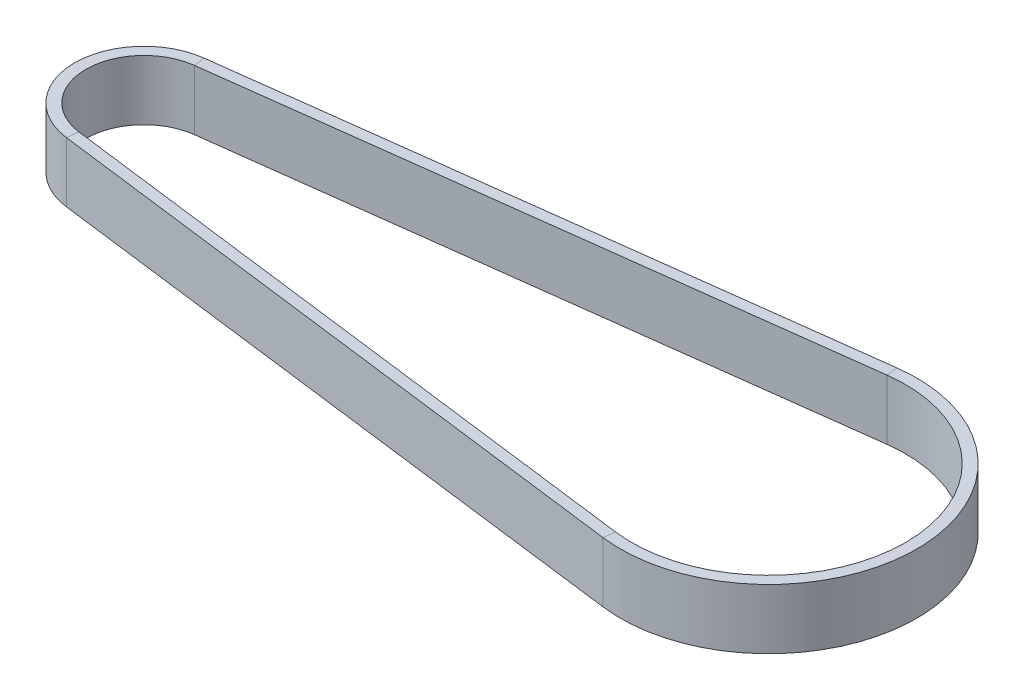
ISO-10303-21;
HEADER;
FILE_DESCRIPTION(('STEP AP214'),'2;1');
FILE_NAME('part.step','',(''),(''),'','','');
FILE_SCHEMA(('AUTOMOTIVE_DESIGN { 1 0 10303 214 1 1 1 1 }'));
ENDSEC;
DATA;
#1=APPLICATION_CONTEXT('core data for automotive mechanical design processes');
#2=APPLICATION_PROTOCOL_DEFINITION('international standard','automotive_design',2000,#1);
#3=PRODUCT_CONTEXT('',#1,'mechanical');
#4=PRODUCT('Part','Part','',(#3));
#5=PRODUCT_RELATED_PRODUCT_CATEGORY('part','',(#4));
#6=PRODUCT_DEFINITION_FORMATION('','',#4);
#7=PRODUCT_DEFINITION_CONTEXT('part definition',#1,'design');
#8=PRODUCT_DEFINITION('design','',#6,#7);
#9=PRODUCT_DEFINITION_SHAPE('','',#8);
#10=(LENGTH_UNIT() NAMED_UNIT(*) SI_UNIT(.MILLI.,.METRE.));
#11=(NAMED_UNIT(*) PLANE_ANGLE_UNIT() SI_UNIT($,.RADIAN.));
#12=(NAMED_UNIT(*) SI_UNIT($,.STERADIAN.) SOLID_ANGLE_UNIT());
#13=UNCERTAINTY_MEASURE_WITH_UNIT(LENGTH_MEASURE(1.E-05),#10,'distance_accuracy_value','');
#14=(GEOMETRIC_REPRESENTATION_CONTEXT(3) GLOBAL_UNCERTAINTY_ASSIGNED_CONTEXT((#13)) GLOBAL_UNIT_ASSIGNED_CONTEXT((#10,
#11,#12)) REPRESENTATION_CONTEXT('',''));
#15=CARTESIAN_POINT('',(0.,0.,0.));
#16=DIRECTION('',(0.,0.,1.));
#17=DIRECTION('',(1.,0.,0.));
#18=AXIS2_PLACEMENT_3D('',#15,#16,#17);
#19=CARTESIAN_POINT('',(916.037735882682,0.,128.730051616606));
#20=DIRECTION('',(0.,1.,0.));
#21=DIRECTION('',(0.,0.,1.));
#22=AXIS2_PLACEMENT_3D('',#19,#20,#21);
#23=CYLINDRICAL_SURFACE('',#22,36.5);
#24=DIRECTION('',(0.,-1.,0.));
#25=VECTOR('',#24,1.);
#26=CARTESIAN_POINT('',(911.435631291215,8.,164.938760974013));
#27=LINE('',#26,#25);
#28=CARTESIAN_POINT('',(911.435631291215,8.,164.938760974013));
#29=VERTEX_POINT('',#28);
#30=CARTESIAN_POINT('',(911.435631291215,-8.,164.938760974013));
#31=VERTEX_POINT('',#30);
#32=EDGE_CURVE('E149',#29,#31,#27,.T.);
#33=ORIENTED_EDGE('',*,*,#32,.F.);
#34=CARTESIAN_POINT('',(916.037735882682,8.,128.730051616606));
#35=DIRECTION('',(0.,1.,0.));
#36=DIRECTION('',(-0.126085057300454,0.,0.992019434449518));
#37=AXIS2_PLACEMENT_3D('',#34,#35,#36);
#38=CIRCLE('',#37,36.5);
#39=CARTESIAN_POINT('',(911.435631291216,8.,92.5213422591982));
#40=VERTEX_POINT('',#39);
#41=EDGE_CURVE('E148',#29,#40,#38,.T.);
#42=ORIENTED_EDGE('',*,*,#41,.T.);
#43=DIRECTION('',(0.,-1.,0.));
#44=VECTOR('',#43,1.);
#45=CARTESIAN_POINT('',(911.435631291216,8.,92.5213422591982));
#46=LINE('',#45,#44);
#47=CARTESIAN_POINT('',(911.435631291216,-8.,92.5213422591982));
#48=VERTEX_POINT('',#47);
#49=EDGE_CURVE('E127',#40,#48,#46,.T.);
#50=ORIENTED_EDGE('',*,*,#49,.T.);
#51=CARTESIAN_POINT('',(916.037735882682,-8.,128.730051616606));
#52=DIRECTION('',(0.,1.,0.));
#53=DIRECTION('',(-0.126085057300454,0.,0.992019434449518));
#54=AXIS2_PLACEMENT_3D('',#51,#52,#53);
#55=CIRCLE('',#54,36.5);
#56=EDGE_CURVE('E153',#31,#48,#55,.T.);
#57=ORIENTED_EDGE('',*,*,#56,.F.);
#58=EDGE_LOOP('',(#33,#42,#50,#57));
#59=FACE_BOUND('',#58,.T.);
#60=ADVANCED_FACE('F33',(#59),#23,.F.);
#61=CARTESIAN_POINT('',(911.435631291216,8.,92.5213422591982));
#62=DIRECTION('',(-0.126085057300452,0.,-0.992019434449518));
#63=DIRECTION('',(-0.992019434449518,0.,0.126085057300452));
#64=AXIS2_PLACEMENT_3D('',#61,#62,#63);
#65=PLANE('',#64);
#66=DIRECTION('',(-0.992019434449518,0.,0.126085057300452));
#67=VECTOR('',#66,1.);
#68=CARTESIAN_POINT('',(911.435631291216,-8.,92.5213422591982));
#69=LINE('',#68,#67);
#70=CARTESIAN_POINT('',(747.529184585241,-8.,113.353750382638));
#71=VERTEX_POINT('',#70);
#72=EDGE_CURVE('E117',#48,#71,#69,.T.);
#73=ORIENTED_EDGE('',*,*,#72,.F.);
#74=ORIENTED_EDGE('',*,*,#49,.F.);
#75=DIRECTION('',(-0.992019434449518,0.,0.126085057300452));
#76=VECTOR('',#75,1.);
#77=CARTESIAN_POINT('',(911.435631291216,8.,92.5213422591982));
#78=LINE('',#77,#76);
#79=CARTESIAN_POINT('',(747.529184585241,8.,113.353750382638));
#80=VERTEX_POINT('',#79);
#81=EDGE_CURVE('E130',#40,#80,#78,.T.);
#82=ORIENTED_EDGE('',*,*,#81,.T.);
#83=DIRECTION('',(0.,-1.,0.));
#84=VECTOR('',#83,1.);
#85=CARTESIAN_POINT('',(747.529184585241,8.,113.353750382638));
#86=LINE('',#85,#84);
#87=EDGE_CURVE('E145',#80,#71,#86,.T.);
#88=ORIENTED_EDGE('',*,*,#87,.T.);
#89=EDGE_LOOP('',(#73,#74,#82,#88));
#90=FACE_BOUND('',#89,.T.);
#91=ADVANCED_FACE('F129',(#90),#65,.F.);
#92=CARTESIAN_POINT('',(911.435631291216,-8.,92.5213422591982));
#93=DIRECTION('',(0.,1.,0.));
#94=DIRECTION('',(0.,0.,1.));
#95=AXIS2_PLACEMENT_3D('',#92,#93,#94);
#96=PLANE('',#95);
#97=DIRECTION('',(-0.992019434449518,0.,0.126085057300452));
#98=VECTOR('',#97,1.);
#99=CARTESIAN_POINT('',(911.057376119314,-8.,89.5452839558497));
#100=LINE('',#99,#98);
#101=CARTESIAN_POINT('',(911.057376119314,-8.,89.5452839558497));
#102=VERTEX_POINT('',#101);
#103=CARTESIAN_POINT('',(747.150929413339,-8.,110.37769207929));
#104=VERTEX_POINT('',#103);
#105=EDGE_CURVE('E111',#102,#104,#100,.T.);
#106=ORIENTED_EDGE('',*,*,#105,.F.);
#107=DIRECTION('',(-0.126085057300458,0.,-0.992019434449517));
#108=VECTOR('',#107,1.);
#109=CARTESIAN_POINT('',(911.435631291216,-8.,92.5213422591982));
#110=LINE('',#109,#108);
#111=EDGE_CURVE('E135',#48,#102,#110,.T.);
#112=ORIENTED_EDGE('',*,*,#111,.F.);
#113=ORIENTED_EDGE('',*,*,#72,.T.);
#114=DIRECTION('',(-0.126085057300458,0.,-0.992019434449517));
#115=VECTOR('',#114,1.);
#116=CARTESIAN_POINT('',(747.529184585241,-8.,113.353750382638));
#117=LINE('',#116,#115);
#118=EDGE_CURVE('E200',#71,#104,#117,.T.);
#119=ORIENTED_EDGE('',*,*,#118,.T.);
#120=EDGE_LOOP('',(#106,#112,#113,#119));
#121=FACE_BOUND('',#120,.T.);
#122=ADVANCED_FACE('F216',(#121),#96,.F.);
#123=CARTESIAN_POINT('',(911.057376119314,8.,89.5452839558497));
#124=DIRECTION('',(0.126085057300452,0.,0.992019434449518));
#125=DIRECTION('',(0.992019434449518,0.,-0.126085057300452));
#126=AXIS2_PLACEMENT_3D('',#123,#124,#125);
#127=PLANE('',#126);
#128=DIRECTION('',(-0.992019434449518,0.,0.126085057300452));
#129=VECTOR('',#128,1.);
#130=CARTESIAN_POINT('',(911.057376119314,8.,89.5452839558497));
#131=LINE('',#130,#129);
#132=CARTESIAN_POINT('',(911.057376119314,8.,89.5452839558497));
#133=VERTEX_POINT('',#132);
#134=CARTESIAN_POINT('',(747.150929413339,8.,110.37769207929));
#135=VERTEX_POINT('',#134);
#136=EDGE_CURVE('E163',#133,#135,#131,.T.);
#137=ORIENTED_EDGE('',*,*,#136,.F.);
#138=DIRECTION('',(0.,1.,0.));
#139=VECTOR('',#138,1.);
#140=CARTESIAN_POINT('',(911.057376119314,8.,89.5452839558497));
#141=LINE('',#140,#139);
#142=EDGE_CURVE('E156',#102,#133,#141,.T.);
#143=ORIENTED_EDGE('',*,*,#142,.F.);
#144=ORIENTED_EDGE('',*,*,#105,.T.);
#145=DIRECTION('',(0.,1.,0.));
#146=VECTOR('',#145,1.);
#147=CARTESIAN_POINT('',(747.150929413339,8.,110.37769207929));
#148=LINE('',#147,#146);
#149=EDGE_CURVE('E185',#104,#135,#148,.T.);
#150=ORIENTED_EDGE('',*,*,#149,.T.);
#151=EDGE_LOOP('',(#137,#143,#144,#150));
#152=FACE_BOUND('',#151,.T.);
#153=ADVANCED_FACE('F186',(#152),#127,.F.);
#154=CARTESIAN_POINT('',(911.435631291216,8.,92.5213422591982));
#155=DIRECTION('',(0.,-1.,0.));
#156=DIRECTION('',(0.,0.,-1.));
#157=AXIS2_PLACEMENT_3D('',#154,#155,#156);
#158=PLANE('',#157);
#159=DIRECTION('',(0.126085057300458,0.,0.992019434449517));
#160=VECTOR('',#159,1.);
#161=CARTESIAN_POINT('',(747.529184585241,8.,113.353750382638));
#162=LINE('',#161,#160);
#163=EDGE_CURVE('E143',#135,#80,#162,.T.);
#164=ORIENTED_EDGE('',*,*,#163,.T.);
#165=ORIENTED_EDGE('',*,*,#81,.F.);
#166=DIRECTION('',(0.126085057300458,0.,0.992019434449517));
#167=VECTOR('',#166,1.);
#168=CARTESIAN_POINT('',(911.435631291216,8.,92.5213422591982));
#169=LINE('',#168,#167);
#170=EDGE_CURVE('E142',#133,#40,#169,.T.);
#171=ORIENTED_EDGE('',*,*,#170,.F.);
#172=ORIENTED_EDGE('',*,*,#136,.T.);
#173=EDGE_LOOP('',(#164,#165,#171,#172));
#174=FACE_BOUND('',#173,.T.);
#175=ADVANCED_FACE('F140',(#174),#158,.F.);
#176=CARTESIAN_POINT('',(749.483502973397,0.,128.730051616606));
#177=DIRECTION('',(0.,1.,0.));
#178=DIRECTION('',(0.,0.,1.));
#179=AXIS2_PLACEMENT_3D('',#176,#177,#178);
#180=CYLINDRICAL_SURFACE('',#179,15.500000000002);
#181=CARTESIAN_POINT('',(749.483502973397,-8.,128.730051616606));
#182=DIRECTION('',(0.,1.,0.));
#183=DIRECTION('',(-0.126085057300411,0.,-0.992019434449523));
#184=AXIS2_PLACEMENT_3D('',#181,#182,#183);
#185=CIRCLE('',#184,15.500000000002);
#186=CARTESIAN_POINT('',(747.52918458524,-8.,144.106352850575));
#187=VERTEX_POINT('',#186);
#188=EDGE_CURVE('E98',#71,#187,#185,.T.);
#189=ORIENTED_EDGE('',*,*,#188,.F.);
#190=ORIENTED_EDGE('',*,*,#87,.F.);
#191=CARTESIAN_POINT('',(749.483502973397,8.,128.730051616606));
#192=DIRECTION('',(0.,1.,0.));
#193=DIRECTION('',(-0.126085057300412,0.,-0.992019434449523));
#194=AXIS2_PLACEMENT_3D('',#191,#192,#193);
#195=CIRCLE('',#194,15.500000000002);
#196=CARTESIAN_POINT('',(747.52918458524,8.,144.106352850575));
#197=VERTEX_POINT('',#196);
#198=EDGE_CURVE('E162',#80,#197,#195,.T.);
#199=ORIENTED_EDGE('',*,*,#198,.T.);
#200=DIRECTION('',(0.,-1.,0.));
#201=VECTOR('',#200,1.);
#202=CARTESIAN_POINT('',(747.52918458524,8.,144.106352850573));
#203=LINE('',#202,#201);
#204=EDGE_CURVE('E191',#197,#187,#203,.T.);
#205=ORIENTED_EDGE('',*,*,#204,.T.);
#206=EDGE_LOOP('',(#189,#190,#199,#205));
#207=FACE_BOUND('',#206,.T.);
#208=ADVANCED_FACE('F215',(#207),#180,.F.);
#209=CARTESIAN_POINT('',(747.529184585241,-8.,113.353750382636));
#210=DIRECTION('',(0.,1.,0.));
#211=DIRECTION('',(0.,0.,1.));
#212=AXIS2_PLACEMENT_3D('',#209,#210,#211);
#213=PLANE('',#212);
#214=CARTESIAN_POINT('',(749.483502973397,-8.,128.730051616606));
#215=DIRECTION('',(0.,1.,0.));
#216=DIRECTION('',(-0.126085057300419,0.,-0.992019434449522));
#217=AXIS2_PLACEMENT_3D('',#214,#215,#216);
#218=CIRCLE('',#217,18.500000000002);
#219=CARTESIAN_POINT('',(747.150929413338,-8.,147.082411153924));
#220=VERTEX_POINT('',#219);
#221=EDGE_CURVE('E91',#104,#220,#218,.T.);
#222=ORIENTED_EDGE('',*,*,#221,.F.);
#223=ORIENTED_EDGE('',*,*,#118,.F.);
#224=ORIENTED_EDGE('',*,*,#188,.T.);
#225=DIRECTION('',(-0.126085057300443,0.,0.992019434449519));
#226=VECTOR('',#225,1.);
#227=CARTESIAN_POINT('',(747.52918458524,-8.,144.106352850573));
#228=LINE('',#227,#226);
#229=EDGE_CURVE('E203',#187,#220,#228,.T.);
#230=ORIENTED_EDGE('',*,*,#229,.T.);
#231=EDGE_LOOP('',(#222,#223,#224,#230));
#232=FACE_BOUND('',#231,.T.);
#233=ADVANCED_FACE('F205',(#232),#213,.F.);
#234=CARTESIAN_POINT('',(749.483502973397,0.,128.730051616606));
#235=DIRECTION('',(0.,1.,0.));
#236=DIRECTION('',(0.,0.,1.));
#237=AXIS2_PLACEMENT_3D('',#234,#235,#236);
#238=CYLINDRICAL_SURFACE('',#237,18.500000000002);
#239=CARTESIAN_POINT('',(749.483502973397,8.,128.730051616606));
#240=DIRECTION('',(0.,1.,0.));
#241=DIRECTION('',(-0.126085057300419,0.,-0.992019434449522));
#242=AXIS2_PLACEMENT_3D('',#239,#240,#241);
#243=CIRCLE('',#242,18.500000000002);
#244=CARTESIAN_POINT('',(747.150929413338,8.,147.082411153924));
#245=VERTEX_POINT('',#244);
#246=EDGE_CURVE('E82',#135,#245,#243,.T.);
#247=ORIENTED_EDGE('',*,*,#246,.F.);
#248=ORIENTED_EDGE('',*,*,#149,.F.);
#249=ORIENTED_EDGE('',*,*,#221,.T.);
#250=DIRECTION('',(0.,1.,0.));
#251=VECTOR('',#250,1.);
#252=CARTESIAN_POINT('',(747.150929413339,8.,147.082411153922));
#253=LINE('',#252,#251);
#254=EDGE_CURVE('E169',#220,#245,#253,.T.);
#255=ORIENTED_EDGE('',*,*,#254,.T.);
#256=EDGE_LOOP('',(#247,#248,#249,#255));
#257=FACE_BOUND('',#256,.T.);
#258=ADVANCED_FACE('F187',(#257),#238,.T.);
#259=CARTESIAN_POINT('',(747.529184585241,8.,113.353750382636));
#260=DIRECTION('',(0.,-1.,0.));
#261=DIRECTION('',(0.,0.,-1.));
#262=AXIS2_PLACEMENT_3D('',#259,#260,#261);
#263=PLANE('',#262);
#264=DIRECTION('',(0.126085057300443,0.,-0.992019434449519));
#265=VECTOR('',#264,1.);
#266=CARTESIAN_POINT('',(747.52918458524,8.,144.106352850573));
#267=LINE('',#266,#265);
#268=EDGE_CURVE('E164',#245,#197,#267,.T.);
#269=ORIENTED_EDGE('',*,*,#268,.T.);
#270=ORIENTED_EDGE('',*,*,#198,.F.);
#271=ORIENTED_EDGE('',*,*,#163,.F.);
#272=ORIENTED_EDGE('',*,*,#246,.T.);
#273=EDGE_LOOP('',(#269,#270,#271,#272));
#274=FACE_BOUND('',#273,.T.);
#275=ADVANCED_FACE('F188',(#274),#263,.F.);
#276=CARTESIAN_POINT('',(747.52918458524,8.,144.106352850573));
#277=DIRECTION('',(-0.126085057300452,0.,0.992019434449518));
#278=DIRECTION('',(0.992019434449518,0.,0.126085057300452));
#279=AXIS2_PLACEMENT_3D('',#276,#277,#278);
#280=PLANE('',#279);
#281=DIRECTION('',(0.992019434449518,0.,0.126085057300452));
#282=VECTOR('',#281,1.);
#283=CARTESIAN_POINT('',(747.52918458524,-8.,144.106352850573));
#284=LINE('',#283,#282);
#285=EDGE_CURVE('E167',#187,#31,#284,.T.);
#286=ORIENTED_EDGE('',*,*,#285,.F.);
#287=ORIENTED_EDGE('',*,*,#204,.F.);
#288=DIRECTION('',(0.992019434449518,0.,0.126085057300452));
#289=VECTOR('',#288,1.);
#290=CARTESIAN_POINT('',(747.52918458524,8.,144.106352850573));
#291=LINE('',#290,#289);
#292=EDGE_CURVE('E165',#197,#29,#291,.T.);
#293=ORIENTED_EDGE('',*,*,#292,.T.);
#294=ORIENTED_EDGE('',*,*,#32,.T.);
#295=EDGE_LOOP('',(#286,#287,#293,#294));
#296=FACE_BOUND('',#295,.T.);
#297=ADVANCED_FACE('F214',(#296),#280,.F.);
#298=CARTESIAN_POINT('',(747.52918458524,-8.,144.106352850573));
#299=DIRECTION('',(0.,1.,0.));
#300=DIRECTION('',(0.,0.,1.));
#301=AXIS2_PLACEMENT_3D('',#298,#299,#300);
#302=PLANE('',#301);
#303=DIRECTION('',(0.992019434449518,0.,0.126085057300452));
#304=VECTOR('',#303,1.);
#305=CARTESIAN_POINT('',(747.150929413339,-8.,147.082411153922));
#306=LINE('',#305,#304);
#307=CARTESIAN_POINT('',(911.057376119314,-8.,167.914819277362));
#308=VERTEX_POINT('',#307);
#309=EDGE_CURVE('E58',#220,#308,#306,.T.);
#310=ORIENTED_EDGE('',*,*,#309,.F.);
#311=ORIENTED_EDGE('',*,*,#229,.F.);
#312=ORIENTED_EDGE('',*,*,#285,.T.);
#313=DIRECTION('',(-0.126085057300446,0.,0.992019434449519));
#314=VECTOR('',#313,1.);
#315=CARTESIAN_POINT('',(911.435631291215,-8.,164.938760974013));
#316=LINE('',#315,#314);
#317=EDGE_CURVE('E175',#31,#308,#316,.T.);
#318=ORIENTED_EDGE('',*,*,#317,.T.);
#319=EDGE_LOOP('',(#310,#311,#312,#318));
#320=FACE_BOUND('',#319,.T.);
#321=ADVANCED_FACE('F207',(#320),#302,.F.);
#322=CARTESIAN_POINT('',(747.150929413339,8.,147.082411153922));
#323=DIRECTION('',(0.126085057300452,0.,-0.992019434449518));
#324=DIRECTION('',(-0.992019434449518,0.,-0.126085057300452));
#325=AXIS2_PLACEMENT_3D('',#322,#323,#324);
#326=PLANE('',#325);
#327=DIRECTION('',(0.992019434449518,0.,0.126085057300452));
#328=VECTOR('',#327,1.);
#329=CARTESIAN_POINT('',(747.150929413339,8.,147.082411153922));
#330=LINE('',#329,#328);
#331=CARTESIAN_POINT('',(911.057376119314,8.,167.914819277362));
#332=VERTEX_POINT('',#331);
#333=EDGE_CURVE('E50',#245,#332,#330,.T.);
#334=ORIENTED_EDGE('',*,*,#333,.F.);
#335=ORIENTED_EDGE('',*,*,#254,.F.);
#336=ORIENTED_EDGE('',*,*,#309,.T.);
#337=DIRECTION('',(0.,1.,0.));
#338=VECTOR('',#337,1.);
#339=CARTESIAN_POINT('',(911.057376119314,8.,167.914819277362));
#340=LINE('',#339,#338);
#341=EDGE_CURVE('E174',#308,#332,#340,.T.);
#342=ORIENTED_EDGE('',*,*,#341,.T.);
#343=EDGE_LOOP('',(#334,#335,#336,#342));
#344=FACE_BOUND('',#343,.T.);
#345=ADVANCED_FACE('F210',(#344),#326,.F.);
#346=CARTESIAN_POINT('',(747.52918458524,8.,144.106352850573));
#347=DIRECTION('',(0.,-1.,0.));
#348=DIRECTION('',(0.,0.,-1.));
#349=AXIS2_PLACEMENT_3D('',#346,#347,#348);
#350=PLANE('',#349);
#351=DIRECTION('',(0.126085057300446,0.,-0.992019434449519));
#352=VECTOR('',#351,1.);
#353=CARTESIAN_POINT('',(911.435631291215,8.,164.938760974013));
#354=LINE('',#353,#352);
#355=EDGE_CURVE('E37',#332,#29,#354,.T.);
#356=ORIENTED_EDGE('',*,*,#355,.T.);
#357=ORIENTED_EDGE('',*,*,#292,.F.);
#358=ORIENTED_EDGE('',*,*,#268,.F.);
#359=ORIENTED_EDGE('',*,*,#333,.T.);
#360=EDGE_LOOP('',(#356,#357,#358,#359));
#361=FACE_BOUND('',#360,.T.);
#362=ADVANCED_FACE('F211',(#361),#350,.F.);
#363=CARTESIAN_POINT('',(911.435631291215,-8.,164.938760974013));
#364=DIRECTION('',(0.,1.,0.));
#365=DIRECTION('',(0.,0.,1.));
#366=AXIS2_PLACEMENT_3D('',#363,#364,#365);
#367=PLANE('',#366);
#368=ORIENTED_EDGE('',*,*,#56,.T.);
#369=ORIENTED_EDGE('',*,*,#111,.T.);
#370=CARTESIAN_POINT('',(916.037735882682,-8.,128.730051616606));
#371=DIRECTION('',(0.,1.,0.));
#372=DIRECTION('',(-0.126085057300455,0.,0.992019434449518));
#373=AXIS2_PLACEMENT_3D('',#370,#371,#372);
#374=CIRCLE('',#373,39.5000000000001);
#375=EDGE_CURVE('E42',#308,#102,#374,.T.);
#376=ORIENTED_EDGE('',*,*,#375,.F.);
#377=ORIENTED_EDGE('',*,*,#317,.F.);
#378=EDGE_LOOP('',(#368,#369,#376,#377));
#379=FACE_BOUND('',#378,.T.);
#380=ADVANCED_FACE('F219',(#379),#367,.F.);
#381=CARTESIAN_POINT('',(916.037735882682,0.,128.730051616606));
#382=DIRECTION('',(0.,1.,0.));
#383=DIRECTION('',(0.,0.,1.));
#384=AXIS2_PLACEMENT_3D('',#381,#382,#383);
#385=CYLINDRICAL_SURFACE('',#384,39.5000000000001);
#386=ORIENTED_EDGE('',*,*,#375,.T.);
#387=ORIENTED_EDGE('',*,*,#142,.T.);
#388=CARTESIAN_POINT('',(916.037735882682,8.,128.730051616606));
#389=DIRECTION('',(0.,1.,0.));
#390=DIRECTION('',(-0.126085057300455,0.,0.992019434449518));
#391=AXIS2_PLACEMENT_3D('',#388,#389,#390);
#392=CIRCLE('',#391,39.5000000000001);
#393=EDGE_CURVE('E11',#332,#133,#392,.T.);
#394=ORIENTED_EDGE('',*,*,#393,.F.);
#395=ORIENTED_EDGE('',*,*,#341,.F.);
#396=EDGE_LOOP('',(#386,#387,#394,#395));
#397=FACE_BOUND('',#396,.T.);
#398=ADVANCED_FACE('F221',(#397),#385,.T.);
#399=CARTESIAN_POINT('',(911.435631291215,8.,164.938760974013));
#400=DIRECTION('',(0.,-1.,0.));
#401=DIRECTION('',(0.,0.,-1.));
#402=AXIS2_PLACEMENT_3D('',#399,#400,#401);
#403=PLANE('',#402);
#404=ORIENTED_EDGE('',*,*,#393,.T.);
#405=ORIENTED_EDGE('',*,*,#170,.T.);
#406=ORIENTED_EDGE('',*,*,#41,.F.);
#407=ORIENTED_EDGE('',*,*,#355,.F.);
#408=EDGE_LOOP('',(#404,#405,#406,#407));
#409=FACE_BOUND('',#408,.T.);
#410=ADVANCED_FACE('F35',(#409),#403,.F.);
#411=CLOSED_SHELL('',(#60,#91,#122,#153,#175,#208,#233,#258,#275,#297,#321,#345,#362,#380,#398,#410));
#412=MANIFOLD_SOLID_BREP('B2',#411);
#413=ADVANCED_BREP_SHAPE_REPRESENTATION('',(#18,#412),#14);
#414=SHAPE_DEFINITION_REPRESENTATION(#9,#413);
ENDSEC;
END-ISO-10303-21;
